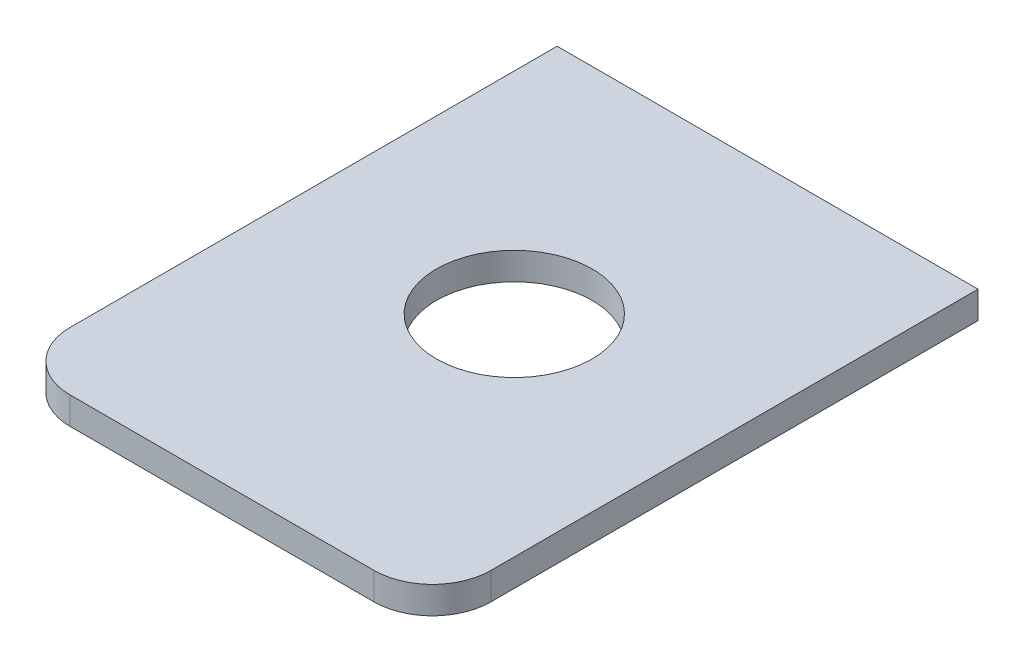
ISO-10303-21;
HEADER;
FILE_DESCRIPTION(('STEP AP214'),'2;1');
FILE_NAME('part.step','',(''),(''),'','','');
FILE_SCHEMA(('AUTOMOTIVE_DESIGN { 1 0 10303 214 1 1 1 1 }'));
ENDSEC;
DATA;
#1=APPLICATION_CONTEXT('core data for automotive mechanical design processes');
#2=APPLICATION_PROTOCOL_DEFINITION('international standard','automotive_design',2000,#1);
#3=PRODUCT_CONTEXT('',#1,'mechanical');
#4=PRODUCT('Part','Part','',(#3));
#5=PRODUCT_RELATED_PRODUCT_CATEGORY('part','',(#4));
#6=PRODUCT_DEFINITION_FORMATION('','',#4);
#7=PRODUCT_DEFINITION_CONTEXT('part definition',#1,'design');
#8=PRODUCT_DEFINITION('design','',#6,#7);
#9=PRODUCT_DEFINITION_SHAPE('','',#8);
#10=(LENGTH_UNIT() NAMED_UNIT(*) SI_UNIT(.MILLI.,.METRE.));
#11=(NAMED_UNIT(*) PLANE_ANGLE_UNIT() SI_UNIT($,.RADIAN.));
#12=(NAMED_UNIT(*) SI_UNIT($,.STERADIAN.) SOLID_ANGLE_UNIT());
#13=UNCERTAINTY_MEASURE_WITH_UNIT(LENGTH_MEASURE(1.E-05),#10,'distance_accuracy_value','');
#14=(GEOMETRIC_REPRESENTATION_CONTEXT(3) GLOBAL_UNCERTAINTY_ASSIGNED_CONTEXT((#13)) GLOBAL_UNIT_ASSIGNED_CONTEXT((#10,
#11,#12)) REPRESENTATION_CONTEXT('',''));
#15=CARTESIAN_POINT('',(0.,0.,0.));
#16=DIRECTION('',(0.,0.,1.));
#17=DIRECTION('',(1.,0.,0.));
#18=AXIS2_PLACEMENT_3D('',#15,#16,#17);
#19=CARTESIAN_POINT('',(-3.73953728865365,17.9504195270786,87.8198540020841));
#20=DIRECTION('',(0.,1.,0.));
#21=DIRECTION('',(0.,0.,1.));
#22=AXIS2_PLACEMENT_3D('',#19,#20,#21);
#23=PLANE('',#22);
#24=CARTESIAN_POINT('',(-5.86105340387706,17.9504195270786,82.7));
#25=DIRECTION('',(0.,1.,0.));
#26=DIRECTION('',(0.,0.,1.));
#27=AXIS2_PLACEMENT_3D('',#24,#25,#26);
#28=CIRCLE('',#27,4.);
#29=CARTESIAN_POINT('',(-5.86105340387706,17.9504195270786,86.7));
#30=VERTEX_POINT('',#29);
#31=EDGE_CURVE('E97',#30,#30,#28,.T.);
#32=ORIENTED_EDGE('',*,*,#31,.T.);
#33=EDGE_LOOP('',(#32));
#34=FACE_BOUND('',#33,.T.);
#35=DIRECTION('',(1.,0.,0.));
#36=VECTOR('',#35,1.);
#37=CARTESIAN_POINT('',(-16.6610534038771,17.9504195270786,97.7));
#38=LINE('',#37,#36);
#39=CARTESIAN_POINT('',(-13.6610534038771,17.9504195270786,97.7));
#40=VERTEX_POINT('',#39);
#41=CARTESIAN_POINT('',(1.93894659612294,17.9504195270786,97.7));
#42=VERTEX_POINT('',#41);
#43=EDGE_CURVE('E78',#40,#42,#38,.T.);
#44=ORIENTED_EDGE('',*,*,#43,.F.);
#45=CARTESIAN_POINT('',(-13.6610534038771,17.9504195270786,94.7));
#46=DIRECTION('',(0.,1.,0.));
#47=DIRECTION('',(0.,0.,1.));
#48=AXIS2_PLACEMENT_3D('',#45,#46,#47);
#49=CIRCLE('',#48,3.);
#50=CARTESIAN_POINT('',(-16.6610534038771,17.9504195270786,94.7));
#51=VERTEX_POINT('',#50);
#52=EDGE_CURVE('E21',#51,#40,#49,.T.);
#53=ORIENTED_EDGE('',*,*,#52,.F.);
#54=DIRECTION('',(0.,0.,1.));
#55=VECTOR('',#54,1.);
#56=CARTESIAN_POINT('',(-16.6610534038771,17.9504195270786,69.7));
#57=LINE('',#56,#55);
#58=CARTESIAN_POINT('',(-16.6610534038771,17.9504195270786,69.7));
#59=VERTEX_POINT('',#58);
#60=EDGE_CURVE('E76',#59,#51,#57,.T.);
#61=ORIENTED_EDGE('',*,*,#60,.F.);
#62=DIRECTION('',(-1.,0.,0.));
#63=VECTOR('',#62,1.);
#64=CARTESIAN_POINT('',(4.93894659612294,17.9504195270786,69.7));
#65=LINE('',#64,#63);
#66=CARTESIAN_POINT('',(4.93894659612294,17.9504195270786,69.7));
#67=VERTEX_POINT('',#66);
#68=EDGE_CURVE('E98',#67,#59,#65,.T.);
#69=ORIENTED_EDGE('',*,*,#68,.F.);
#70=DIRECTION('',(0.,0.,-1.));
#71=VECTOR('',#70,1.);
#72=CARTESIAN_POINT('',(4.93894659612294,17.9504195270786,97.7));
#73=LINE('',#72,#71);
#74=CARTESIAN_POINT('',(4.93894659612294,17.9504195270786,94.7));
#75=VERTEX_POINT('',#74);
#76=EDGE_CURVE('E108',#75,#67,#73,.T.);
#77=ORIENTED_EDGE('',*,*,#76,.F.);
#78=CARTESIAN_POINT('',(1.93894659612294,17.9504195270786,94.7));
#79=DIRECTION('',(0.,1.,0.));
#80=DIRECTION('',(0.,0.,1.));
#81=AXIS2_PLACEMENT_3D('',#78,#79,#80);
#82=CIRCLE('',#81,3.);
#83=EDGE_CURVE('E80',#42,#75,#82,.T.);
#84=ORIENTED_EDGE('',*,*,#83,.F.);
#85=EDGE_LOOP('',(#44,#53,#61,#69,#77,#84));
#86=FACE_BOUND('',#85,.T.);
#87=ADVANCED_FACE('F18',(#34,#86),#23,.F.);
#88=CARTESIAN_POINT('',(-16.6610534038771,19.3504195270786,69.7));
#89=DIRECTION('',(-1.,0.,0.));
#90=DIRECTION('',(0.,0.,1.));
#91=AXIS2_PLACEMENT_3D('',#88,#89,#90);
#92=PLANE('',#91);
#93=ORIENTED_EDGE('',*,*,#60,.T.);
#94=DIRECTION('',(0.,1.,0.));
#95=VECTOR('',#94,1.);
#96=CARTESIAN_POINT('',(-16.6610534038771,19.3504195270786,94.7));
#97=LINE('',#96,#95);
#98=CARTESIAN_POINT('',(-16.6610534038771,19.3504195270786,94.7));
#99=VERTEX_POINT('',#98);
#100=EDGE_CURVE('E75',#99,#51,#97,.F.);
#101=ORIENTED_EDGE('',*,*,#100,.F.);
#102=DIRECTION('',(0.,0.,1.));
#103=VECTOR('',#102,1.);
#104=CARTESIAN_POINT('',(-16.6610534038771,19.3504195270786,87.8198540020841));
#105=LINE('',#104,#103);
#106=CARTESIAN_POINT('',(-16.6610534038771,19.3504195270786,69.7));
#107=VERTEX_POINT('',#106);
#108=EDGE_CURVE('E119',#107,#99,#105,.T.);
#109=ORIENTED_EDGE('',*,*,#108,.F.);
#110=DIRECTION('',(0.,1.,0.));
#111=VECTOR('',#110,1.);
#112=CARTESIAN_POINT('',(-16.6610534038771,19.3504195270786,69.7));
#113=LINE('',#112,#111);
#114=EDGE_CURVE('E94',#59,#107,#113,.T.);
#115=ORIENTED_EDGE('',*,*,#114,.F.);
#116=EDGE_LOOP('',(#93,#101,#109,#115));
#117=FACE_BOUND('',#116,.T.);
#118=ADVANCED_FACE('F150',(#117),#92,.T.);
#119=CARTESIAN_POINT('',(-13.6610534038771,19.3504195270786,94.7));
#120=DIRECTION('',(0.,1.,0.));
#121=DIRECTION('',(0.,0.,1.));
#122=AXIS2_PLACEMENT_3D('',#119,#120,#121);
#123=CYLINDRICAL_SURFACE('',#122,3.);
#124=CARTESIAN_POINT('',(-13.6610534038771,19.3504195270786,94.7));
#125=DIRECTION('',(0.,1.,0.));
#126=DIRECTION('',(0.,0.,1.));
#127=AXIS2_PLACEMENT_3D('',#124,#125,#126);
#128=CIRCLE('',#127,3.);
#129=CARTESIAN_POINT('',(-13.6610534038771,19.3504195270786,97.7));
#130=VERTEX_POINT('',#129);
#131=EDGE_CURVE('E117',#99,#130,#128,.T.);
#132=ORIENTED_EDGE('',*,*,#131,.F.);
#133=ORIENTED_EDGE('',*,*,#100,.T.);
#134=ORIENTED_EDGE('',*,*,#52,.T.);
#135=DIRECTION('',(0.,1.,0.));
#136=VECTOR('',#135,1.);
#137=CARTESIAN_POINT('',(-13.6610534038771,19.3504195270786,97.7));
#138=LINE('',#137,#136);
#139=EDGE_CURVE('E73',#130,#40,#138,.F.);
#140=ORIENTED_EDGE('',*,*,#139,.F.);
#141=EDGE_LOOP('',(#132,#133,#134,#140));
#142=FACE_BOUND('',#141,.T.);
#143=ADVANCED_FACE('F71',(#142),#123,.T.);
#144=CARTESIAN_POINT('',(-16.6610534038771,19.3504195270786,97.7));
#145=DIRECTION('',(0.,0.,1.));
#146=DIRECTION('',(1.,0.,0.));
#147=AXIS2_PLACEMENT_3D('',#144,#145,#146);
#148=PLANE('',#147);
#149=ORIENTED_EDGE('',*,*,#43,.T.);
#150=DIRECTION('',(0.,1.,0.));
#151=VECTOR('',#150,1.);
#152=CARTESIAN_POINT('',(1.93894659612294,19.3504195270786,97.7));
#153=LINE('',#152,#151);
#154=CARTESIAN_POINT('',(1.93894659612294,19.3504195270786,97.7));
#155=VERTEX_POINT('',#154);
#156=EDGE_CURVE('E91',#155,#42,#153,.F.);
#157=ORIENTED_EDGE('',*,*,#156,.F.);
#158=DIRECTION('',(1.,0.,0.));
#159=VECTOR('',#158,1.);
#160=CARTESIAN_POINT('',(-3.73953728865365,19.3504195270786,97.7));
#161=LINE('',#160,#159);
#162=EDGE_CURVE('E86',#130,#155,#161,.T.);
#163=ORIENTED_EDGE('',*,*,#162,.F.);
#164=ORIENTED_EDGE('',*,*,#139,.T.);
#165=EDGE_LOOP('',(#149,#157,#163,#164));
#166=FACE_BOUND('',#165,.T.);
#167=ADVANCED_FACE('F84',(#166),#148,.T.);
#168=CARTESIAN_POINT('',(1.93894659612294,19.3504195270786,94.7));
#169=DIRECTION('',(0.,1.,0.));
#170=DIRECTION('',(0.,0.,1.));
#171=AXIS2_PLACEMENT_3D('',#168,#169,#170);
#172=CYLINDRICAL_SURFACE('',#171,3.);
#173=CARTESIAN_POINT('',(1.93894659612294,19.3504195270786,94.7));
#174=DIRECTION('',(0.,1.,0.));
#175=DIRECTION('',(0.,0.,1.));
#176=AXIS2_PLACEMENT_3D('',#173,#174,#175);
#177=CIRCLE('',#176,3.);
#178=CARTESIAN_POINT('',(4.93894659612294,19.3504195270786,94.7));
#179=VERTEX_POINT('',#178);
#180=EDGE_CURVE('E113',#155,#179,#177,.T.);
#181=ORIENTED_EDGE('',*,*,#180,.F.);
#182=ORIENTED_EDGE('',*,*,#156,.T.);
#183=ORIENTED_EDGE('',*,*,#83,.T.);
#184=DIRECTION('',(0.,1.,0.));
#185=VECTOR('',#184,1.);
#186=CARTESIAN_POINT('',(4.93894659612294,19.3504195270786,94.7));
#187=LINE('',#186,#185);
#188=EDGE_CURVE('E110',#179,#75,#187,.F.);
#189=ORIENTED_EDGE('',*,*,#188,.F.);
#190=EDGE_LOOP('',(#181,#182,#183,#189));
#191=FACE_BOUND('',#190,.T.);
#192=ADVANCED_FACE('F124',(#191),#172,.T.);
#193=CARTESIAN_POINT('',(4.93894659612294,19.3504195270786,97.7));
#194=DIRECTION('',(1.,0.,0.));
#195=DIRECTION('',(0.,0.,-1.));
#196=AXIS2_PLACEMENT_3D('',#193,#194,#195);
#197=PLANE('',#196);
#198=DIRECTION('',(0.,0.,1.));
#199=VECTOR('',#198,1.);
#200=CARTESIAN_POINT('',(4.93894659612294,19.3504195270786,87.8198540020841));
#201=LINE('',#200,#199);
#202=CARTESIAN_POINT('',(4.93894659612294,19.3504195270786,69.7));
#203=VERTEX_POINT('',#202);
#204=EDGE_CURVE('E116',#179,#203,#201,.F.);
#205=ORIENTED_EDGE('',*,*,#204,.F.);
#206=ORIENTED_EDGE('',*,*,#188,.T.);
#207=ORIENTED_EDGE('',*,*,#76,.T.);
#208=DIRECTION('',(0.,1.,0.));
#209=VECTOR('',#208,1.);
#210=CARTESIAN_POINT('',(4.93894659612294,19.3504195270786,69.7));
#211=LINE('',#210,#209);
#212=EDGE_CURVE('E36',#203,#67,#211,.F.);
#213=ORIENTED_EDGE('',*,*,#212,.F.);
#214=EDGE_LOOP('',(#205,#206,#207,#213));
#215=FACE_BOUND('',#214,.T.);
#216=ADVANCED_FACE('F147',(#215),#197,.T.);
#217=CARTESIAN_POINT('',(4.93894659612294,19.3504195270786,69.7));
#218=DIRECTION('',(0.,0.,-1.));
#219=DIRECTION('',(-1.,0.,0.));
#220=AXIS2_PLACEMENT_3D('',#217,#218,#219);
#221=PLANE('',#220);
#222=ORIENTED_EDGE('',*,*,#68,.T.);
#223=ORIENTED_EDGE('',*,*,#114,.T.);
#224=DIRECTION('',(1.,0.,0.));
#225=VECTOR('',#224,1.);
#226=CARTESIAN_POINT('',(-3.73953728865365,19.3504195270786,69.7));
#227=LINE('',#226,#225);
#228=EDGE_CURVE('E27',#203,#107,#227,.F.);
#229=ORIENTED_EDGE('',*,*,#228,.F.);
#230=ORIENTED_EDGE('',*,*,#212,.T.);
#231=EDGE_LOOP('',(#222,#223,#229,#230));
#232=FACE_BOUND('',#231,.T.);
#233=ADVANCED_FACE('F144',(#232),#221,.T.);
#234=CARTESIAN_POINT('',(-5.86105340387706,19.3504195270786,82.7));
#235=DIRECTION('',(0.,1.,0.));
#236=DIRECTION('',(0.,0.,1.));
#237=AXIS2_PLACEMENT_3D('',#234,#235,#236);
#238=CYLINDRICAL_SURFACE('',#237,4.);
#239=CARTESIAN_POINT('',(-5.86105340387706,19.3504195270786,82.7));
#240=DIRECTION('',(0.,1.,0.));
#241=DIRECTION('',(0.,0.,1.));
#242=AXIS2_PLACEMENT_3D('',#239,#240,#241);
#243=CIRCLE('',#242,4.);
#244=CARTESIAN_POINT('',(-5.86105340387706,19.3504195270786,86.7));
#245=VERTEX_POINT('',#244);
#246=EDGE_CURVE('E11',#245,#245,#243,.F.);
#247=ORIENTED_EDGE('',*,*,#246,.F.);
#248=EDGE_LOOP('',(#247));
#249=FACE_BOUND('',#248,.T.);
#250=ORIENTED_EDGE('',*,*,#31,.F.);
#251=EDGE_LOOP('',(#250));
#252=FACE_BOUND('',#251,.T.);
#253=ADVANCED_FACE('F160',(#249,#252),#238,.F.);
#254=CARTESIAN_POINT('',(-3.73953728865365,19.3504195270786,87.8198540020841));
#255=DIRECTION('',(0.,1.,0.));
#256=DIRECTION('',(0.,0.,1.));
#257=AXIS2_PLACEMENT_3D('',#254,#255,#256);
#258=PLANE('',#257);
#259=ORIENTED_EDGE('',*,*,#246,.T.);
#260=EDGE_LOOP('',(#259));
#261=FACE_BOUND('',#260,.T.);
#262=ORIENTED_EDGE('',*,*,#204,.T.);
#263=ORIENTED_EDGE('',*,*,#228,.T.);
#264=ORIENTED_EDGE('',*,*,#108,.T.);
#265=ORIENTED_EDGE('',*,*,#131,.T.);
#266=ORIENTED_EDGE('',*,*,#162,.T.);
#267=ORIENTED_EDGE('',*,*,#180,.T.);
#268=EDGE_LOOP('',(#262,#263,#264,#265,#266,#267));
#269=FACE_BOUND('',#268,.T.);
#270=ADVANCED_FACE('F127',(#261,#269),#258,.T.);
#271=CLOSED_SHELL('',(#87,#118,#143,#167,#192,#216,#233,#253,#270));
#272=MANIFOLD_SOLID_BREP('B1',#271);
#273=ADVANCED_BREP_SHAPE_REPRESENTATION('',(#18,#272),#14);
#274=SHAPE_DEFINITION_REPRESENTATION(#9,#273);
ENDSEC;
END-ISO-10303-21;
